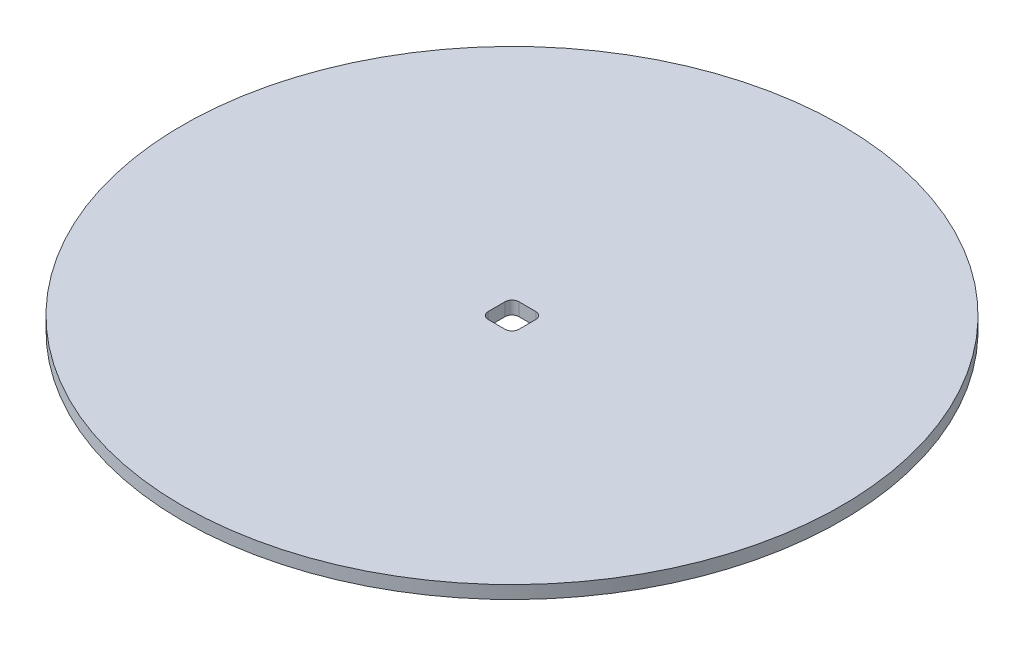
ISO-10303-21;
HEADER;
FILE_DESCRIPTION(('STEP AP214'),'2;1');
FILE_NAME('part.step','',(''),(''),'','','');
FILE_SCHEMA(('AUTOMOTIVE_DESIGN { 1 0 10303 214 1 1 1 1 }'));
ENDSEC;
DATA;
#1=APPLICATION_CONTEXT('core data for automotive mechanical design processes');
#2=APPLICATION_PROTOCOL_DEFINITION('international standard','automotive_design',2000,#1);
#3=PRODUCT_CONTEXT('',#1,'mechanical');
#4=PRODUCT('Part','Part','',(#3));
#5=PRODUCT_RELATED_PRODUCT_CATEGORY('part','',(#4));
#6=PRODUCT_DEFINITION_FORMATION('','',#4);
#7=PRODUCT_DEFINITION_CONTEXT('part definition',#1,'design');
#8=PRODUCT_DEFINITION('design','',#6,#7);
#9=PRODUCT_DEFINITION_SHAPE('','',#8);
#10=(LENGTH_UNIT() NAMED_UNIT(*) SI_UNIT(.MILLI.,.METRE.));
#11=(NAMED_UNIT(*) PLANE_ANGLE_UNIT() SI_UNIT($,.RADIAN.));
#12=(NAMED_UNIT(*) SI_UNIT($,.STERADIAN.) SOLID_ANGLE_UNIT());
#13=UNCERTAINTY_MEASURE_WITH_UNIT(LENGTH_MEASURE(1.E-05),#10,'distance_accuracy_value','');
#14=(GEOMETRIC_REPRESENTATION_CONTEXT(3) GLOBAL_UNCERTAINTY_ASSIGNED_CONTEXT((#13)) GLOBAL_UNIT_ASSIGNED_CONTEXT((#10,
#11,#12)) REPRESENTATION_CONTEXT('',''));
#15=CARTESIAN_POINT('',(0.,0.,0.));
#16=DIRECTION('',(0.,0.,1.));
#17=DIRECTION('',(1.,0.,0.));
#18=AXIS2_PLACEMENT_3D('',#15,#16,#17);
#19=CARTESIAN_POINT('',(1.9685,3.,1.9685));
#20=DIRECTION('',(0.,-1.,0.));
#21=DIRECTION('',(0.,0.,-1.));
#22=AXIS2_PLACEMENT_3D('',#19,#20,#21);
#23=CYLINDRICAL_SURFACE('',#22,1.5875);
#24=CARTESIAN_POINT('',(1.9685,0.,1.9685));
#25=DIRECTION('',(0.,-1.,0.));
#26=DIRECTION('',(0.,0.,-1.));
#27=AXIS2_PLACEMENT_3D('',#24,#25,#26);
#28=CIRCLE('',#27,1.5875);
#29=CARTESIAN_POINT('',(3.55599996210321,0.,1.9685));
#30=VERTEX_POINT('',#29);
#31=CARTESIAN_POINT('',(1.9685,0.,3.55599996210321));
#32=VERTEX_POINT('',#31);
#33=EDGE_CURVE('E143',#30,#32,#28,.T.);
#34=ORIENTED_EDGE('',*,*,#33,.T.);
#35=DIRECTION('',(0.,-1.,0.));
#36=VECTOR('',#35,1.);
#37=CARTESIAN_POINT('',(1.9685,1.5,3.556));
#38=LINE('',#37,#36);
#39=CARTESIAN_POINT('',(1.9685,3.,3.55599996210321));
#40=VERTEX_POINT('',#39);
#41=EDGE_CURVE('E125',#40,#32,#38,.T.);
#42=ORIENTED_EDGE('',*,*,#41,.F.);
#43=CARTESIAN_POINT('',(1.9685,3.,1.9685));
#44=DIRECTION('',(0.,-1.,0.));
#45=DIRECTION('',(0.,0.,-1.));
#46=AXIS2_PLACEMENT_3D('',#43,#44,#45);
#47=CIRCLE('',#46,1.5875);
#48=CARTESIAN_POINT('',(3.55599996210321,3.,1.9685));
#49=VERTEX_POINT('',#48);
#50=EDGE_CURVE('E140',#49,#40,#47,.T.);
#51=ORIENTED_EDGE('',*,*,#50,.F.);
#52=DIRECTION('',(0.,1.,0.));
#53=VECTOR('',#52,1.);
#54=CARTESIAN_POINT('',(3.556,1.5,1.9685));
#55=LINE('',#54,#53);
#56=EDGE_CURVE('E113',#30,#49,#55,.T.);
#57=ORIENTED_EDGE('',*,*,#56,.F.);
#58=EDGE_LOOP('',(#34,#42,#51,#57));
#59=FACE_BOUND('',#58,.T.);
#60=ADVANCED_FACE('F17',(#59),#23,.F.);
#61=CARTESIAN_POINT('',(1.9685,0.,3.556));
#62=DIRECTION('',(0.,0.,-1.));
#63=DIRECTION('',(-1.,0.,0.));
#64=AXIS2_PLACEMENT_3D('',#61,#62,#63);
#65=PLANE('',#64);
#66=DIRECTION('',(0.,1.,0.));
#67=VECTOR('',#66,1.);
#68=CARTESIAN_POINT('',(-1.9685000006512,1.5,3.556));
#69=LINE('',#68,#67);
#70=CARTESIAN_POINT('',(-1.9685000003256,3.,3.55599996210321));
#71=VERTEX_POINT('',#70);
#72=CARTESIAN_POINT('',(-1.9685000003256,0.,3.55599996210321));
#73=VERTEX_POINT('',#72);
#74=EDGE_CURVE('E89',#71,#73,#69,.F.);
#75=ORIENTED_EDGE('',*,*,#74,.F.);
#76=DIRECTION('',(-1.,0.,0.));
#77=VECTOR('',#76,1.);
#78=CARTESIAN_POINT('',(0.,3.,3.55599992420641));
#79=LINE('',#78,#77);
#80=EDGE_CURVE('E139',#40,#71,#79,.T.);
#81=ORIENTED_EDGE('',*,*,#80,.F.);
#82=ORIENTED_EDGE('',*,*,#41,.T.);
#83=DIRECTION('',(-1.,0.,0.));
#84=VECTOR('',#83,1.);
#85=CARTESIAN_POINT('',(0.,0.,3.55599992420641));
#86=LINE('',#85,#84);
#87=EDGE_CURVE('E79',#32,#73,#86,.T.);
#88=ORIENTED_EDGE('',*,*,#87,.T.);
#89=EDGE_LOOP('',(#75,#81,#82,#88));
#90=FACE_BOUND('',#89,.T.);
#91=ADVANCED_FACE('F168',(#90),#65,.T.);
#92=CARTESIAN_POINT('',(-1.9685,3.,1.9685));
#93=DIRECTION('',(0.,-1.,0.));
#94=DIRECTION('',(0.,0.,-1.));
#95=AXIS2_PLACEMENT_3D('',#92,#93,#94);
#96=CYLINDRICAL_SURFACE('',#95,1.5875);
#97=CARTESIAN_POINT('',(-1.9685,0.,1.9685));
#98=DIRECTION('',(0.,-1.,0.));
#99=DIRECTION('',(0.,0.,-1.));
#100=AXIS2_PLACEMENT_3D('',#97,#98,#99);
#101=CIRCLE('',#100,1.5875);
#102=CARTESIAN_POINT('',(-3.5559999621032,0.,1.9685));
#103=VERTEX_POINT('',#102);
#104=EDGE_CURVE('E21',#73,#103,#101,.T.);
#105=ORIENTED_EDGE('',*,*,#104,.T.);
#106=DIRECTION('',(0.,-1.,0.));
#107=VECTOR('',#106,1.);
#108=CARTESIAN_POINT('',(-3.556,1.5,1.9685));
#109=LINE('',#108,#107);
#110=CARTESIAN_POINT('',(-3.5559999621032,3.,1.9685));
#111=VERTEX_POINT('',#110);
#112=EDGE_CURVE('E87',#111,#103,#109,.T.);
#113=ORIENTED_EDGE('',*,*,#112,.F.);
#114=CARTESIAN_POINT('',(-1.9685,3.,1.9685));
#115=DIRECTION('',(0.,-1.,0.));
#116=DIRECTION('',(0.,0.,-1.));
#117=AXIS2_PLACEMENT_3D('',#114,#115,#116);
#118=CIRCLE('',#117,1.5875);
#119=EDGE_CURVE('E137',#71,#111,#118,.T.);
#120=ORIENTED_EDGE('',*,*,#119,.F.);
#121=ORIENTED_EDGE('',*,*,#74,.T.);
#122=EDGE_LOOP('',(#105,#113,#120,#121));
#123=FACE_BOUND('',#122,.T.);
#124=ADVANCED_FACE('F85',(#123),#96,.F.);
#125=CARTESIAN_POINT('',(-3.556,0.,1.9685));
#126=DIRECTION('',(1.,0.,0.));
#127=DIRECTION('',(0.,0.,-1.));
#128=AXIS2_PLACEMENT_3D('',#125,#126,#127);
#129=PLANE('',#128);
#130=DIRECTION('',(0.,1.,0.));
#131=VECTOR('',#130,1.);
#132=CARTESIAN_POINT('',(-3.556,1.5,-1.96849999938931));
#133=LINE('',#132,#131);
#134=CARTESIAN_POINT('',(-3.5559999621032,3.,-1.96849999969465));
#135=VERTEX_POINT('',#134);
#136=CARTESIAN_POINT('',(-3.5559999621032,0.,-1.96849999969465));
#137=VERTEX_POINT('',#136);
#138=EDGE_CURVE('E99',#135,#137,#133,.F.);
#139=ORIENTED_EDGE('',*,*,#138,.F.);
#140=DIRECTION('',(0.,0.,-1.));
#141=VECTOR('',#140,1.);
#142=CARTESIAN_POINT('',(-3.5559999242064,3.,0.));
#143=LINE('',#142,#141);
#144=EDGE_CURVE('E97',#111,#135,#143,.T.);
#145=ORIENTED_EDGE('',*,*,#144,.F.);
#146=ORIENTED_EDGE('',*,*,#112,.T.);
#147=DIRECTION('',(0.,0.,-1.));
#148=VECTOR('',#147,1.);
#149=CARTESIAN_POINT('',(-3.5559999242064,0.,0.));
#150=LINE('',#149,#148);
#151=EDGE_CURVE('E92',#103,#137,#150,.T.);
#152=ORIENTED_EDGE('',*,*,#151,.T.);
#153=EDGE_LOOP('',(#139,#145,#146,#152));
#154=FACE_BOUND('',#153,.T.);
#155=ADVANCED_FACE('F94',(#154),#129,.T.);
#156=CARTESIAN_POINT('',(-1.9685,3.,-1.9685));
#157=DIRECTION('',(0.,-1.,0.));
#158=DIRECTION('',(0.,0.,-1.));
#159=AXIS2_PLACEMENT_3D('',#156,#157,#158);
#160=CYLINDRICAL_SURFACE('',#159,1.5875);
#161=CARTESIAN_POINT('',(-1.9685,0.,-1.9685));
#162=DIRECTION('',(0.,-1.,0.));
#163=DIRECTION('',(0.,0.,-1.));
#164=AXIS2_PLACEMENT_3D('',#161,#162,#163);
#165=CIRCLE('',#164,1.5875);
#166=CARTESIAN_POINT('',(-1.9685,0.,-3.5559999621032));
#167=VERTEX_POINT('',#166);
#168=EDGE_CURVE('E106',#137,#167,#165,.T.);
#169=ORIENTED_EDGE('',*,*,#168,.T.);
#170=DIRECTION('',(0.,-1.,0.));
#171=VECTOR('',#170,1.);
#172=CARTESIAN_POINT('',(-1.9685,1.5,-3.556));
#173=LINE('',#172,#171);
#174=CARTESIAN_POINT('',(-1.9685,3.,-3.5559999621032));
#175=VERTEX_POINT('',#174);
#176=EDGE_CURVE('E120',#175,#167,#173,.T.);
#177=ORIENTED_EDGE('',*,*,#176,.F.);
#178=CARTESIAN_POINT('',(-1.9685,3.,-1.9685));
#179=DIRECTION('',(0.,-1.,0.));
#180=DIRECTION('',(0.,0.,-1.));
#181=AXIS2_PLACEMENT_3D('',#178,#179,#180);
#182=CIRCLE('',#181,1.5875);
#183=EDGE_CURVE('E134',#135,#175,#182,.T.);
#184=ORIENTED_EDGE('',*,*,#183,.F.);
#185=ORIENTED_EDGE('',*,*,#138,.T.);
#186=EDGE_LOOP('',(#169,#177,#184,#185));
#187=FACE_BOUND('',#186,.T.);
#188=ADVANCED_FACE('F190',(#187),#160,.F.);
#189=CARTESIAN_POINT('',(-1.9685,0.,-3.556));
#190=DIRECTION('',(0.,0.,1.));
#191=DIRECTION('',(1.,0.,0.));
#192=AXIS2_PLACEMENT_3D('',#189,#190,#191);
#193=PLANE('',#192);
#194=DIRECTION('',(0.,1.,0.));
#195=VECTOR('',#194,1.);
#196=CARTESIAN_POINT('',(1.9685,1.5,-3.556));
#197=LINE('',#196,#195);
#198=CARTESIAN_POINT('',(1.9685,3.,-3.5559999621032));
#199=VERTEX_POINT('',#198);
#200=CARTESIAN_POINT('',(1.9685,0.,-3.5559999621032));
#201=VERTEX_POINT('',#200);
#202=EDGE_CURVE('E115',#199,#201,#197,.F.);
#203=ORIENTED_EDGE('',*,*,#202,.F.);
#204=DIRECTION('',(1.,0.,0.));
#205=VECTOR('',#204,1.);
#206=CARTESIAN_POINT('',(0.,3.,-3.5559999242064));
#207=LINE('',#206,#205);
#208=EDGE_CURVE('E133',#175,#199,#207,.T.);
#209=ORIENTED_EDGE('',*,*,#208,.F.);
#210=ORIENTED_EDGE('',*,*,#176,.T.);
#211=DIRECTION('',(1.,0.,0.));
#212=VECTOR('',#211,1.);
#213=CARTESIAN_POINT('',(0.,0.,-3.5559999242064));
#214=LINE('',#213,#212);
#215=EDGE_CURVE('E108',#167,#201,#214,.T.);
#216=ORIENTED_EDGE('',*,*,#215,.T.);
#217=EDGE_LOOP('',(#203,#209,#210,#216));
#218=FACE_BOUND('',#217,.T.);
#219=ADVANCED_FACE('F151',(#218),#193,.T.);
#220=CARTESIAN_POINT('',(1.9685,3.,-1.9685));
#221=DIRECTION('',(0.,-1.,0.));
#222=DIRECTION('',(0.,0.,-1.));
#223=AXIS2_PLACEMENT_3D('',#220,#221,#222);
#224=CYLINDRICAL_SURFACE('',#223,1.5875);
#225=CARTESIAN_POINT('',(1.9685,0.,-1.9685));
#226=DIRECTION('',(0.,-1.,0.));
#227=DIRECTION('',(0.,0.,-1.));
#228=AXIS2_PLACEMENT_3D('',#225,#226,#227);
#229=CIRCLE('',#228,1.5875);
#230=CARTESIAN_POINT('',(3.55599996210321,0.,-1.9685));
#231=VERTEX_POINT('',#230);
#232=EDGE_CURVE('E147',#201,#231,#229,.T.);
#233=ORIENTED_EDGE('',*,*,#232,.T.);
#234=DIRECTION('',(0.,-1.,0.));
#235=VECTOR('',#234,1.);
#236=CARTESIAN_POINT('',(3.556,1.5,-1.9685));
#237=LINE('',#236,#235);
#238=CARTESIAN_POINT('',(3.55599996210321,3.,-1.9685));
#239=VERTEX_POINT('',#238);
#240=EDGE_CURVE('E36',#239,#231,#237,.T.);
#241=ORIENTED_EDGE('',*,*,#240,.F.);
#242=CARTESIAN_POINT('',(1.9685,3.,-1.9685));
#243=DIRECTION('',(0.,-1.,0.));
#244=DIRECTION('',(0.,0.,-1.));
#245=AXIS2_PLACEMENT_3D('',#242,#243,#244);
#246=CIRCLE('',#245,1.5875);
#247=EDGE_CURVE('E130',#199,#239,#246,.T.);
#248=ORIENTED_EDGE('',*,*,#247,.F.);
#249=ORIENTED_EDGE('',*,*,#202,.T.);
#250=EDGE_LOOP('',(#233,#241,#248,#249));
#251=FACE_BOUND('',#250,.T.);
#252=ADVANCED_FACE('F153',(#251),#224,.F.);
#253=CARTESIAN_POINT('',(3.556,0.,-1.9685));
#254=DIRECTION('',(-1.,0.,0.));
#255=DIRECTION('',(0.,0.,1.));
#256=AXIS2_PLACEMENT_3D('',#253,#254,#255);
#257=PLANE('',#256);
#258=ORIENTED_EDGE('',*,*,#56,.T.);
#259=DIRECTION('',(0.,0.,1.));
#260=VECTOR('',#259,1.);
#261=CARTESIAN_POINT('',(3.55599992420641,3.,0.));
#262=LINE('',#261,#260);
#263=EDGE_CURVE('E129',#239,#49,#262,.T.);
#264=ORIENTED_EDGE('',*,*,#263,.F.);
#265=ORIENTED_EDGE('',*,*,#240,.T.);
#266=DIRECTION('',(0.,0.,1.));
#267=VECTOR('',#266,1.);
#268=CARTESIAN_POINT('',(3.55599992420641,0.,0.));
#269=LINE('',#268,#267);
#270=EDGE_CURVE('E146',#231,#30,#269,.T.);
#271=ORIENTED_EDGE('',*,*,#270,.T.);
#272=EDGE_LOOP('',(#258,#264,#265,#271));
#273=FACE_BOUND('',#272,.T.);
#274=ADVANCED_FACE('F157',(#273),#257,.T.);
#275=CARTESIAN_POINT('',(-77.1144,0.,-77.1144));
#276=DIRECTION('',(0.,1.,0.));
#277=DIRECTION('',(0.,0.,1.));
#278=AXIS2_PLACEMENT_3D('',#275,#276,#277);
#279=PLANE('',#278);
#280=ORIENTED_EDGE('',*,*,#270,.F.);
#281=ORIENTED_EDGE('',*,*,#232,.F.);
#282=ORIENTED_EDGE('',*,*,#215,.F.);
#283=ORIENTED_EDGE('',*,*,#168,.F.);
#284=ORIENTED_EDGE('',*,*,#151,.F.);
#285=ORIENTED_EDGE('',*,*,#104,.F.);
#286=ORIENTED_EDGE('',*,*,#87,.F.);
#287=ORIENTED_EDGE('',*,*,#33,.F.);
#288=EDGE_LOOP('',(#280,#281,#282,#283,#284,#285,#286,#287));
#289=FACE_BOUND('',#288,.T.);
#290=CARTESIAN_POINT('',(0.,0.,0.));
#291=DIRECTION('',(0.,-1.,0.));
#292=DIRECTION('',(0.,0.,-1.));
#293=AXIS2_PLACEMENT_3D('',#290,#291,#292);
#294=CIRCLE('',#293,76.2);
#295=CARTESIAN_POINT('',(0.,0.,-76.2));
#296=VERTEX_POINT('',#295);
#297=EDGE_CURVE('E27',#296,#296,#294,.T.);
#298=ORIENTED_EDGE('',*,*,#297,.T.);
#299=EDGE_LOOP('',(#298));
#300=FACE_BOUND('',#299,.T.);
#301=ADVANCED_FACE('F103',(#289,#300),#279,.F.);
#302=CARTESIAN_POINT('',(-77.1144,3.,-77.1144));
#303=DIRECTION('',(0.,1.,0.));
#304=DIRECTION('',(0.,0.,1.));
#305=AXIS2_PLACEMENT_3D('',#302,#303,#304);
#306=PLANE('',#305);
#307=ORIENTED_EDGE('',*,*,#247,.T.);
#308=ORIENTED_EDGE('',*,*,#263,.T.);
#309=ORIENTED_EDGE('',*,*,#50,.T.);
#310=ORIENTED_EDGE('',*,*,#80,.T.);
#311=ORIENTED_EDGE('',*,*,#119,.T.);
#312=ORIENTED_EDGE('',*,*,#144,.T.);
#313=ORIENTED_EDGE('',*,*,#183,.T.);
#314=ORIENTED_EDGE('',*,*,#208,.T.);
#315=EDGE_LOOP('',(#307,#308,#309,#310,#311,#312,#313,#314));
#316=FACE_BOUND('',#315,.T.);
#317=CARTESIAN_POINT('',(0.,3.,0.));
#318=DIRECTION('',(0.,-1.,0.));
#319=DIRECTION('',(0.,0.,-1.));
#320=AXIS2_PLACEMENT_3D('',#317,#318,#319);
#321=CIRCLE('',#320,76.2);
#322=CARTESIAN_POINT('',(0.,3.,-76.2));
#323=VERTEX_POINT('',#322);
#324=EDGE_CURVE('E11',#323,#323,#321,.F.);
#325=ORIENTED_EDGE('',*,*,#324,.T.);
#326=EDGE_LOOP('',(#325));
#327=FACE_BOUND('',#326,.T.);
#328=ADVANCED_FACE('F19',(#316,#327),#306,.T.);
#329=CARTESIAN_POINT('',(0.,3.,0.));
#330=DIRECTION('',(0.,-1.,0.));
#331=DIRECTION('',(0.,0.,-1.));
#332=AXIS2_PLACEMENT_3D('',#329,#330,#331);
#333=CYLINDRICAL_SURFACE('',#332,76.2);
#334=ORIENTED_EDGE('',*,*,#297,.F.);
#335=EDGE_LOOP('',(#334));
#336=FACE_BOUND('',#335,.T.);
#337=ORIENTED_EDGE('',*,*,#324,.F.);
#338=EDGE_LOOP('',(#337));
#339=FACE_BOUND('',#338,.T.);
#340=ADVANCED_FACE('F178',(#336,#339),#333,.T.);
#341=CLOSED_SHELL('',(#60,#91,#124,#155,#188,#219,#252,#274,#301,#328,#340));
#342=MANIFOLD_SOLID_BREP('B1',#341);
#343=ADVANCED_BREP_SHAPE_REPRESENTATION('',(#18,#342),#14);
#344=SHAPE_DEFINITION_REPRESENTATION(#9,#343);
ENDSEC;
END-ISO-10303-21;
